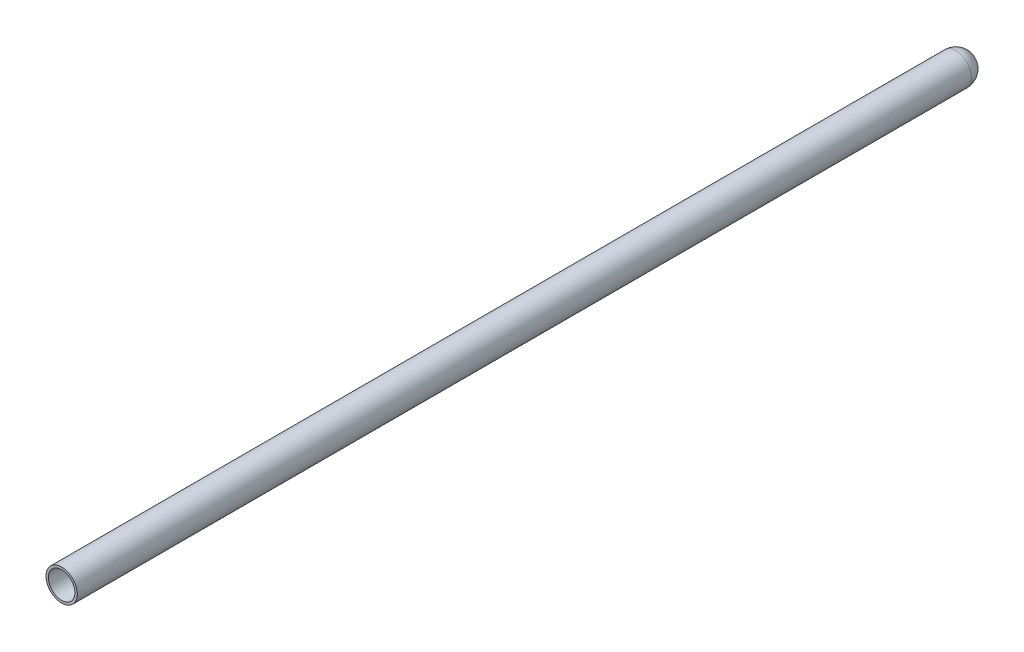
ISO-10303-21;
HEADER;
FILE_DESCRIPTION(('STEP AP214'),'2;1');
FILE_NAME('part.step','',(''),(''),'','','');
FILE_SCHEMA(('AUTOMOTIVE_DESIGN { 1 0 10303 214 1 1 1 1 }'));
ENDSEC;
DATA;
#1=APPLICATION_CONTEXT('core data for automotive mechanical design processes');
#2=APPLICATION_PROTOCOL_DEFINITION('international standard','automotive_design',2000,#1);
#3=PRODUCT_CONTEXT('',#1,'mechanical');
#4=PRODUCT('Part','Part','',(#3));
#5=PRODUCT_RELATED_PRODUCT_CATEGORY('part','',(#4));
#6=PRODUCT_DEFINITION_FORMATION('','',#4);
#7=PRODUCT_DEFINITION_CONTEXT('part definition',#1,'design');
#8=PRODUCT_DEFINITION('design','',#6,#7);
#9=PRODUCT_DEFINITION_SHAPE('','',#8);
#10=(LENGTH_UNIT() NAMED_UNIT(*) SI_UNIT(.MILLI.,.METRE.));
#11=(NAMED_UNIT(*) PLANE_ANGLE_UNIT() SI_UNIT($,.RADIAN.));
#12=(NAMED_UNIT(*) SI_UNIT($,.STERADIAN.) SOLID_ANGLE_UNIT());
#13=UNCERTAINTY_MEASURE_WITH_UNIT(LENGTH_MEASURE(1.E-05),#10,'distance_accuracy_value','');
#14=(GEOMETRIC_REPRESENTATION_CONTEXT(3) GLOBAL_UNCERTAINTY_ASSIGNED_CONTEXT((#13)) GLOBAL_UNIT_ASSIGNED_CONTEXT((#10,
#11,#12)) REPRESENTATION_CONTEXT('',''));
#15=CARTESIAN_POINT('',(0.,0.,0.));
#16=DIRECTION('',(0.,0.,1.));
#17=DIRECTION('',(1.,0.,0.));
#18=AXIS2_PLACEMENT_3D('',#15,#16,#17);
#19=CARTESIAN_POINT('',(2.2,0.,84.6));
#20=DIRECTION('',(0.,0.,1.));
#21=DIRECTION('',(1.,0.,0.));
#22=AXIS2_PLACEMENT_3D('',#19,#20,#21);
#23=PLANE('',#22);
#24=CARTESIAN_POINT('',(0.,0.,84.6));
#25=DIRECTION('',(0.,0.,1.));
#26=DIRECTION('',(1.,0.,0.));
#27=AXIS2_PLACEMENT_3D('',#24,#25,#26);
#28=CIRCLE('',#27,2.6);
#29=CARTESIAN_POINT('',(2.6,0.,84.6));
#30=VERTEX_POINT('',#29);
#31=EDGE_CURVE('E10',#30,#30,#28,.T.);
#32=ORIENTED_EDGE('',*,*,#31,.T.);
#33=EDGE_LOOP('',(#32));
#34=FACE_BOUND('',#33,.T.);
#35=CARTESIAN_POINT('',(0.,0.,84.6));
#36=DIRECTION('',(0.,0.,1.));
#37=DIRECTION('',(1.,0.,0.));
#38=AXIS2_PLACEMENT_3D('',#35,#36,#37);
#39=CIRCLE('',#38,2.2);
#40=CARTESIAN_POINT('',(2.2,0.,84.6));
#41=VERTEX_POINT('',#40);
#42=EDGE_CURVE('E54',#41,#41,#39,.T.);
#43=ORIENTED_EDGE('',*,*,#42,.F.);
#44=EDGE_LOOP('',(#43));
#45=FACE_BOUND('',#44,.T.);
#46=ADVANCED_FACE('F37',(#34,#45),#23,.T.);
#47=CARTESIAN_POINT('',(0.,0.,0.));
#48=DIRECTION('',(0.,0.,1.));
#49=DIRECTION('',(1.,0.,0.));
#50=AXIS2_PLACEMENT_3D('',#47,#48,#49);
#51=CYLINDRICAL_SURFACE('',#50,2.6);
#52=CARTESIAN_POINT('',(0.,0.,-63.8));
#53=DIRECTION('',(0.,0.,1.));
#54=DIRECTION('',(1.,0.,0.));
#55=AXIS2_PLACEMENT_3D('',#52,#53,#54);
#56=CIRCLE('',#55,2.6);
#57=CARTESIAN_POINT('',(2.6,0.,-63.8));
#58=VERTEX_POINT('',#57);
#59=EDGE_CURVE('E44',#58,#58,#56,.T.);
#60=ORIENTED_EDGE('',*,*,#59,.T.);
#61=EDGE_LOOP('',(#60));
#62=FACE_BOUND('',#61,.T.);
#63=ORIENTED_EDGE('',*,*,#31,.F.);
#64=EDGE_LOOP('',(#63));
#65=FACE_BOUND('',#64,.T.);
#66=ADVANCED_FACE('F65',(#62,#65),#51,.T.);
#67=CARTESIAN_POINT('',(0.,0.,-63.8));
#68=DIRECTION('',(0.,0.,1.));
#69=DIRECTION('',(1.,0.,0.));
#70=AXIS2_PLACEMENT_3D('',#67,#68,#69);
#71=SPHERICAL_SURFACE('',#70,2.6);
#72=ORIENTED_EDGE('',*,*,#59,.F.);
#73=EDGE_LOOP('',(#72));
#74=FACE_BOUND('',#73,.T.);
#75=ADVANCED_FACE('F69',(#74),#71,.T.);
#76=CARTESIAN_POINT('',(0.,0.,-63.8));
#77=DIRECTION('',(0.,0.,1.));
#78=DIRECTION('',(1.,0.,0.));
#79=AXIS2_PLACEMENT_3D('',#76,#77,#78);
#80=SPHERICAL_SURFACE('',#79,2.19999999999998);
#81=CARTESIAN_POINT('',(0.,0.,-63.8));
#82=DIRECTION('',(0.,0.,1.));
#83=DIRECTION('',(1.,0.,0.));
#84=AXIS2_PLACEMENT_3D('',#81,#82,#83);
#85=CIRCLE('',#84,2.2);
#86=CARTESIAN_POINT('',(2.2,0.,-63.8));
#87=VERTEX_POINT('',#86);
#88=EDGE_CURVE('E49',#87,#87,#85,.T.);
#89=ORIENTED_EDGE('',*,*,#88,.T.);
#90=EDGE_LOOP('',(#89));
#91=FACE_BOUND('',#90,.T.);
#92=ADVANCED_FACE('F73',(#91),#80,.F.);
#93=CARTESIAN_POINT('',(0.,0.,0.));
#94=DIRECTION('',(0.,0.,1.));
#95=DIRECTION('',(1.,0.,0.));
#96=AXIS2_PLACEMENT_3D('',#93,#94,#95);
#97=CYLINDRICAL_SURFACE('',#96,2.2);
#98=ORIENTED_EDGE('',*,*,#42,.T.);
#99=EDGE_LOOP('',(#98));
#100=FACE_BOUND('',#99,.T.);
#101=ORIENTED_EDGE('',*,*,#88,.F.);
#102=EDGE_LOOP('',(#101));
#103=FACE_BOUND('',#102,.T.);
#104=ADVANCED_FACE('F61',(#100,#103),#97,.F.);
#105=CLOSED_SHELL('',(#46,#66,#75,#92,#104));
#106=MANIFOLD_SOLID_BREP('B2',#105);
#107=ADVANCED_BREP_SHAPE_REPRESENTATION('',(#18,#106),#14);
#108=SHAPE_DEFINITION_REPRESENTATION(#9,#107);
ENDSEC;
END-ISO-10303-21;
